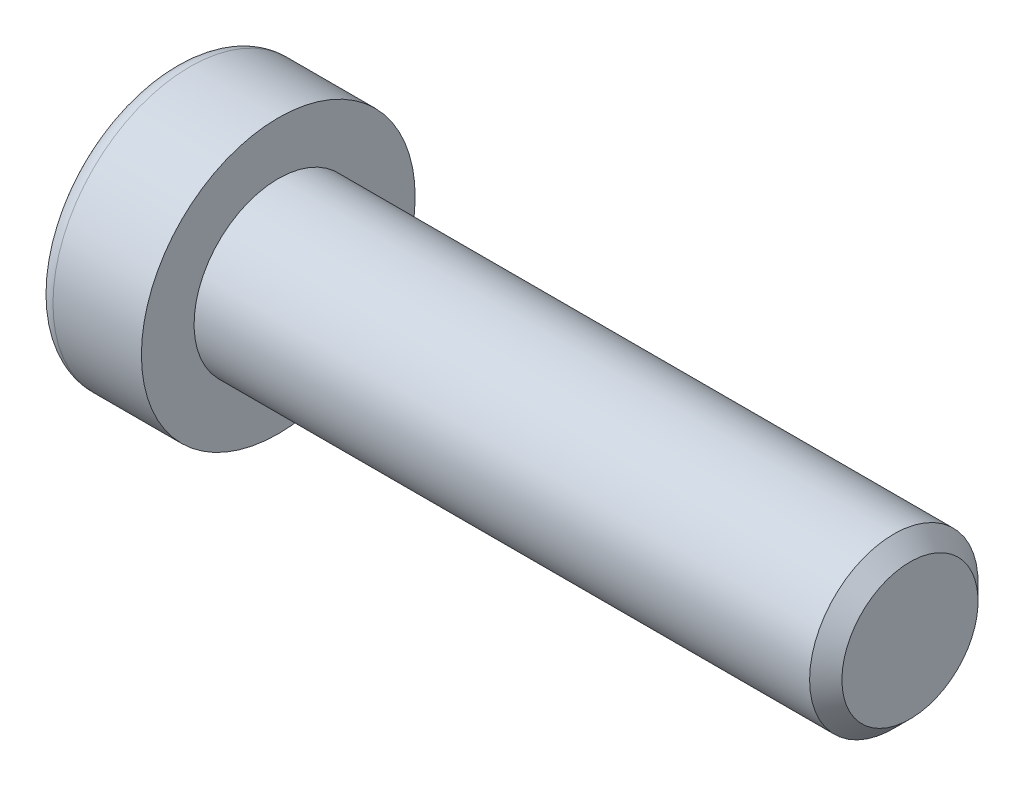
ISO-10303-21;
HEADER;
FILE_DESCRIPTION(('STEP AP214'),'2;1');
FILE_NAME('part.step','',(''),(''),'','','');
FILE_SCHEMA(('AUTOMOTIVE_DESIGN { 1 0 10303 214 1 1 1 1 }'));
ENDSEC;
DATA;
#1=APPLICATION_CONTEXT('core data for automotive mechanical design processes');
#2=APPLICATION_PROTOCOL_DEFINITION('international standard','automotive_design',2000,#1);
#3=PRODUCT_CONTEXT('',#1,'mechanical');
#4=PRODUCT('Part','Part','',(#3));
#5=PRODUCT_RELATED_PRODUCT_CATEGORY('part','',(#4));
#6=PRODUCT_DEFINITION_FORMATION('','',#4);
#7=PRODUCT_DEFINITION_CONTEXT('part definition',#1,'design');
#8=PRODUCT_DEFINITION('design','',#6,#7);
#9=PRODUCT_DEFINITION_SHAPE('','',#8);
#10=(LENGTH_UNIT() NAMED_UNIT(*) SI_UNIT(.MILLI.,.METRE.));
#11=(NAMED_UNIT(*) PLANE_ANGLE_UNIT() SI_UNIT($,.RADIAN.));
#12=(NAMED_UNIT(*) SI_UNIT($,.STERADIAN.) SOLID_ANGLE_UNIT());
#13=UNCERTAINTY_MEASURE_WITH_UNIT(LENGTH_MEASURE(1.E-05),#10,'distance_accuracy_value','');
#14=(GEOMETRIC_REPRESENTATION_CONTEXT(3) GLOBAL_UNCERTAINTY_ASSIGNED_CONTEXT((#13)) GLOBAL_UNIT_ASSIGNED_CONTEXT((#10,
#11,#12)) REPRESENTATION_CONTEXT('',''));
#15=CARTESIAN_POINT('',(0.,0.,0.));
#16=DIRECTION('',(0.,0.,1.));
#17=DIRECTION('',(1.,0.,0.));
#18=AXIS2_PLACEMENT_3D('',#15,#16,#17);
#19=CARTESIAN_POINT('',(-1.21000000177673,0.,0.));
#20=DIRECTION('',(-1.,0.,0.));
#21=DIRECTION('',(0.,0.,1.));
#22=AXIS2_PLACEMENT_3D('',#19,#20,#21);
#23=CONICAL_SURFACE('',#22,2.9040718530382,1.04719754996794);
#24=CARTESIAN_POINT('',(0.466666669012739,-1.13686837721616E-10,0.));
#25=VERTEX_POINT('',#24);
#26=VERTEX_LOOP('',#25);
#27=FACE_BOUND('',#26,.T.);
#28=CARTESIAN_POINT('',(-1.20000000188032,2.50000000042828,1.44337567243126));
#29=CARTESIAN_POINT('',(-1.16336943336427,2.50000000015382,1.31652043353318));
#30=CARTESIAN_POINT('',(-1.13005584831707,2.50000000004123,1.18857018203745));
#31=CARTESIAN_POINT('',(-1.07190798610144,2.49999999995868,0.930454306037677));
#32=CARTESIAN_POINT('',(-1.04709427719735,2.49999999998906,0.800284096806924));
#33=CARTESIAN_POINT('',(-1.00846995036617,2.50000000001067,0.541556812494233));
#34=CARTESIAN_POINT('',(-0.994402236162447,2.50000000000284,0.413039534770439));
#35=CARTESIAN_POINT('',(-0.977611461824864,2.49999999999716,0.155400578562858));
#36=CARTESIAN_POINT('',(-0.974874494142074,2.49999999999929,0.0262798358840899));
#37=CARTESIAN_POINT('',(-0.980582864422355,2.50000000000062,-0.21496841995549));
#38=CARTESIAN_POINT('',(-0.987626608278002,2.50000000000017,-0.327132134383147));
#39=CARTESIAN_POINT('',(-1.00994662771906,2.49999999999983,-0.550728853222557));
#40=CARTESIAN_POINT('',(-1.02523052031715,2.49999999999995,-0.66216108485018));
#41=CARTESIAN_POINT('',(-1.06343729360609,2.50000000000005,-0.886218434015897));
#42=CARTESIAN_POINT('',(-1.08652205474861,2.50000000000003,-0.998815208377872));
#43=CARTESIAN_POINT('',(-1.13891470311393,2.49999999999998,-1.2223298619213));
#44=CARTESIAN_POINT('',(-1.16821028805135,2.49999999999995,-1.33325060237494));
#45=CARTESIAN_POINT('',(-1.20000000215881,2.5,-1.44337567242466));
#46=B_SPLINE_CURVE_WITH_KNOTS('',3,(#28,#29,#30,#31,#32,#33,#34,#35,#36,#37,#38,#39,#40,#41,#42,
#43,#44,#45),.UNSPECIFIED.,.F.,.F.,(4,2,2,2,2,2,2,2,4),(0.,0.396270014515872,0.793492271437725,
1.18088450788727,1.56780111135406,1.90463472821334,2.24178024186127,2.58640202744164,
2.93034746593166),.UNSPECIFIED.);
#47=CARTESIAN_POINT('',(-1.20000000213914,2.49999999973261,1.44337567281968));
#48=VERTEX_POINT('',#47);
#49=CARTESIAN_POINT('',(-1.20000000222827,2.5,-1.44337567266531));
#50=VERTEX_POINT('',#49);
#51=EDGE_CURVE('E19',#48,#50,#46,.T.);
#52=ORIENTED_EDGE('',*,*,#51,.T.);
#53=CARTESIAN_POINT('',(-1.20000000188032,2.49999999974405,-1.44337567361636));
#54=CARTESIAN_POINT('',(-1.16336943336427,2.39014014011794,-1.50680329282772));
#55=CARTESIAN_POINT('',(-1.13005584831707,2.27933197184574,-1.57077841847808));
#56=CARTESIAN_POINT('',(-1.07190798610144,2.05579706606859,-1.69983635640647));
#57=CARTESIAN_POINT('',(-1.04709427719735,1.94306635807401,-1.76492146104816));
#58=CARTESIAN_POINT('',(-1.00846995036617,1.71900195721787,-1.89428510322322));
#59=CARTESIAN_POINT('',(-0.994402236162446,1.60770272987993,-1.95854374207834));
#60=CARTESIAN_POINT('',(-0.977611461824863,1.38458084879682,-2.08736322017721));
#61=CARTESIAN_POINT('',(-0.974874494142074,1.27275900548255,-2.15192359151843));
#62=CARTESIAN_POINT('',(-0.980582864422354,1.06383188730746,-2.27254771943938));
#63=CARTESIAN_POINT('',(-0.987626608278001,0.966695261230055,-2.32862957665281));
#64=CARTESIAN_POINT('',(-1.00994662771905,0.773054822512112,-2.44042793607223));
#65=CARTESIAN_POINT('',(-1.02523052031715,0.676551679122258,-2.49614405188614));
#66=CARTESIAN_POINT('',(-1.06343729360609,0.482512322840195,-2.60817272646909));
#67=CARTESIAN_POINT('',(-1.08652205474861,0.385000655858529,-2.66447111365005));
#68=CARTESIAN_POINT('',(-1.13891470311393,0.191431287771819,-2.77622844042172));
#69=CARTESIAN_POINT('',(-1.16821028805135,0.09537110873237,-2.83168881064853));
#70=CARTESIAN_POINT('',(-1.20000000215881,4.75795613603965E-10,-2.88675134567343));
#71=B_SPLINE_CURVE_WITH_KNOTS('',3,(#53,#54,#55,#56,#57,#58,#59,#60,#61,#62,#63,#64,#65,#66,#67,
#68,#69,#70),.UNSPECIFIED.,.F.,.F.,(4,2,2,2,2,2,2,2,4),(0.,0.396270014515872,0.793492271437724,
1.18088450788727,1.56780111135406,1.90463472821334,2.24178024186127,2.58640202744164,
2.93034746593166),.UNSPECIFIED.);
#72=CARTESIAN_POINT('',(-1.20000000213914,0.,-2.88675134563937));
#73=VERTEX_POINT('',#72);
#74=EDGE_CURVE('E79',#50,#73,#71,.T.);
#75=ORIENTED_EDGE('',*,*,#74,.T.);
#76=CARTESIAN_POINT('',(-1.20000000188032,-6.842196023302E-10,-2.88675134604762));
#77=CARTESIAN_POINT('',(-1.16336943336427,-0.109859860035873,-2.8233237263609));
#78=CARTESIAN_POINT('',(-1.13005584831707,-0.220668028195489,-2.75934860051552));
#79=CARTESIAN_POINT('',(-1.07190798610144,-0.444202933890087,-2.63029066244415));
#80=CARTESIAN_POINT('',(-1.04709427719735,-0.556933641915047,-2.56520555785509));
#81=CARTESIAN_POINT('',(-1.00846995036617,-0.780998042792801,-2.43584191571745));
#82=CARTESIAN_POINT('',(-0.994402236162447,-0.892297270122914,-2.37158327684878));
#83=CARTESIAN_POINT('',(-0.977611461824864,-1.11541915120034,-2.24276379874007));
#84=CARTESIAN_POINT('',(-0.974874494142073,-1.22724099451673,-2.17820342740253));
#85=CARTESIAN_POINT('',(-0.980582864422354,-1.43616811269316,-2.05757929948389));
#86=CARTESIAN_POINT('',(-0.987626608278001,-1.53330473877011,-2.00149744226967));
#87=CARTESIAN_POINT('',(-1.00994662771906,-1.72694517748772,-1.88969908284967));
#88=CARTESIAN_POINT('',(-1.02523052031715,-1.82344832087769,-1.83398296703597));
#89=CARTESIAN_POINT('',(-1.06343729360609,-2.01748767715985,-1.72195429245319));
#90=CARTESIAN_POINT('',(-1.08652205474861,-2.1149993441415,-1.66565590527218));
#91=CARTESIAN_POINT('',(-1.13891470311393,-2.30856871222816,-1.55389857850043));
#92=CARTESIAN_POINT('',(-1.16821028805135,-2.40462889126758,-1.49843820827358));
#93=CARTESIAN_POINT('',(-1.20000000215881,-2.49999999952421,-1.44337567324877));
#94=B_SPLINE_CURVE_WITH_KNOTS('',3,(#76,#77,#78,#79,#80,#81,#82,#83,#84,#85,#86,#87,#88,#89,#90,
#91,#92,#93),.UNSPECIFIED.,.F.,.F.,(4,2,2,2,2,2,2,2,4),(0.,0.396270014515872,0.793492271437725,
1.18088450788727,1.56780111135406,1.90463472821334,2.24178024186127,2.58640202744164,
2.93034746593167),.UNSPECIFIED.);
#95=CARTESIAN_POINT('',(-1.20000000213914,-2.49999999973261,-1.44337567281968));
#96=VERTEX_POINT('',#95);
#97=EDGE_CURVE('E104',#73,#96,#94,.T.);
#98=ORIENTED_EDGE('',*,*,#97,.T.);
#99=CARTESIAN_POINT('',(-1.20000000188032,-2.50000000042828,-1.44337567243126));
#100=CARTESIAN_POINT('',(-1.16336943336427,-2.50000000015382,-1.31652043353318));
#101=CARTESIAN_POINT('',(-1.13005584831707,-2.50000000004123,-1.18857018203745));
#102=CARTESIAN_POINT('',(-1.07190798610144,-2.49999999995868,-0.93045430603768));
#103=CARTESIAN_POINT('',(-1.04709427719735,-2.49999999998906,-0.800284096806928));
#104=CARTESIAN_POINT('',(-1.00846995036617,-2.50000000001067,-0.541556812494236));
#105=CARTESIAN_POINT('',(-0.994402236162447,-2.50000000000284,-0.413039534770443));
#106=CARTESIAN_POINT('',(-0.977611461824863,-2.49999999999716,-0.155400578562862));
#107=CARTESIAN_POINT('',(-0.974874494142073,-2.49999999999929,-0.0262798358840941));
#108=CARTESIAN_POINT('',(-0.980582864422354,-2.50000000000062,0.214968419955486));
#109=CARTESIAN_POINT('',(-0.987626608278001,-2.50000000000017,0.327132134383144));
#110=CARTESIAN_POINT('',(-1.00994662771905,-2.49999999999983,0.550728853222554));
#111=CARTESIAN_POINT('',(-1.02523052031715,-2.49999999999995,0.662161084850177));
#112=CARTESIAN_POINT('',(-1.06343729360609,-2.50000000000005,0.886218434015895));
#113=CARTESIAN_POINT('',(-1.08652205474861,-2.50000000000002,0.99881520837787));
#114=CARTESIAN_POINT('',(-1.13891470311393,-2.49999999999998,1.2223298619213));
#115=CARTESIAN_POINT('',(-1.16821028805135,-2.49999999999995,1.33325060237494));
#116=CARTESIAN_POINT('',(-1.20000000215881,-2.5,1.44337567242466));
#117=B_SPLINE_CURVE_WITH_KNOTS('',3,(#99,#100,#101,#102,#103,#104,#105,#106,#107,#108,#109,#110,
#111,#112,#113,#114,#115,#116),.UNSPECIFIED.,.F.,.F.,(4,2,2,2,2,2,2,2,4),(0.,0.396270014515872,
0.793492271437724,1.18088450788727,1.56780111135406,1.90463472821334,2.24178024186127,
2.58640202744164,2.93034746593167),.UNSPECIFIED.);
#118=CARTESIAN_POINT('',(-1.20000000213914,-2.49999999973261,1.44337567281969));
#119=VERTEX_POINT('',#118);
#120=EDGE_CURVE('E128',#96,#119,#117,.T.);
#121=ORIENTED_EDGE('',*,*,#120,.T.);
#122=CARTESIAN_POINT('',(-1.20000000188032,-2.49999999974406,1.44337567361636));
#123=CARTESIAN_POINT('',(-1.16336943336427,-2.39014014011795,1.50680329282772));
#124=CARTESIAN_POINT('',(-1.13005584831707,-2.27933197184574,1.57077841847807));
#125=CARTESIAN_POINT('',(-1.07190798610144,-2.05579706606859,1.69983635640647));
#126=CARTESIAN_POINT('',(-1.04709427719735,-1.94306635807401,1.76492146104816));
#127=CARTESIAN_POINT('',(-1.00846995036617,-1.71900195721787,1.89428510322322));
#128=CARTESIAN_POINT('',(-0.994402236162447,-1.60770272987993,1.95854374207834));
#129=CARTESIAN_POINT('',(-0.977611461824864,-1.38458084879682,2.08736322017721));
#130=CARTESIAN_POINT('',(-0.974874494142074,-1.27275900548255,2.15192359151843));
#131=CARTESIAN_POINT('',(-0.980582864422354,-1.06383188730746,2.27254771943938));
#132=CARTESIAN_POINT('',(-0.987626608278001,-0.966695261230056,2.32862957665281));
#133=CARTESIAN_POINT('',(-1.00994662771905,-0.773054822512113,2.44042793607223));
#134=CARTESIAN_POINT('',(-1.02523052031715,-0.676551679122259,2.49614405188614));
#135=CARTESIAN_POINT('',(-1.06343729360609,-0.482512322840196,2.60817272646909));
#136=CARTESIAN_POINT('',(-1.08652205474861,-0.385000655858529,2.66447111365005));
#137=CARTESIAN_POINT('',(-1.13891470311393,-0.19143128777182,2.77622844042172));
#138=CARTESIAN_POINT('',(-1.16821028805135,-0.0953711087323703,2.83168881064852));
#139=CARTESIAN_POINT('',(-1.20000000215881,-4.75795563263291E-10,2.88675134567343));
#140=B_SPLINE_CURVE_WITH_KNOTS('',3,(#122,#123,#124,#125,#126,#127,#128,#129,#130,#131,#132,
#133,#134,#135,#136,#137,#138,#139),.UNSPECIFIED.,.F.,.F.,(4,2,2,2,2,2,2,2,4),(0.,
0.396270014515872,0.793492271437724,1.18088450788727,1.56780111135406,1.90463472821334,
2.24178024186127,2.58640202744164,2.93034746593167),.UNSPECIFIED.);
#141=CARTESIAN_POINT('',(-1.20000000213914,0.,2.88675134563937));
#142=VERTEX_POINT('',#141);
#143=EDGE_CURVE('E136',#119,#142,#140,.T.);
#144=ORIENTED_EDGE('',*,*,#143,.T.);
#145=CARTESIAN_POINT('',(-1.20000000188032,6.84218568518227E-10,2.88675134604763));
#146=CARTESIAN_POINT('',(-1.16336943336427,0.109859860035872,2.8233237263609));
#147=CARTESIAN_POINT('',(-1.13005584831707,0.220668028195487,2.75934860051552));
#148=CARTESIAN_POINT('',(-1.07190798610144,0.444202933890086,2.63029066244415));
#149=CARTESIAN_POINT('',(-1.04709427719735,0.556933641915045,2.56520555785509));
#150=CARTESIAN_POINT('',(-1.00846995036617,0.7809980427928,2.43584191571745));
#151=CARTESIAN_POINT('',(-0.994402236162446,0.892297270122912,2.37158327684878));
#152=CARTESIAN_POINT('',(-0.977611461824863,1.11541915120034,2.24276379874007));
#153=CARTESIAN_POINT('',(-0.974874494142073,1.22724099451673,2.17820342740253));
#154=CARTESIAN_POINT('',(-0.980582864422353,1.43616811269316,2.05757929948389));
#155=CARTESIAN_POINT('',(-0.987626608278,1.53330473877011,2.00149744226967));
#156=CARTESIAN_POINT('',(-1.00994662771905,1.72694517748772,1.88969908284967));
#157=CARTESIAN_POINT('',(-1.02523052031715,1.82344832087769,1.83398296703596));
#158=CARTESIAN_POINT('',(-1.06343729360609,2.01748767715985,1.72195429245319));
#159=CARTESIAN_POINT('',(-1.08652205474861,2.1149993441415,1.66565590527218));
#160=CARTESIAN_POINT('',(-1.13891470311393,2.30856871222816,1.55389857850042));
#161=CARTESIAN_POINT('',(-1.16821028805135,2.40462889126758,1.49843820827358));
#162=CARTESIAN_POINT('',(-1.2000000021588,2.49999999952421,1.44337567324876));
#163=B_SPLINE_CURVE_WITH_KNOTS('',3,(#145,#146,#147,#148,#149,#150,#151,#152,#153,#154,#155,
#156,#157,#158,#159,#160,#161,#162),.UNSPECIFIED.,.F.,.F.,(4,2,2,2,2,2,2,2,4),(0.,
0.396270014515872,0.793492271437725,1.18088450788727,1.56780111135406,1.90463472821334,
2.24178024186127,2.58640202744164,2.93034746593167),.UNSPECIFIED.);
#164=EDGE_CURVE('E81',#142,#48,#163,.T.);
#165=ORIENTED_EDGE('',*,*,#164,.T.);
#166=EDGE_LOOP('',(#52,#75,#98,#121,#144,#165));
#167=FACE_BOUND('',#166,.T.);
#168=ADVANCED_FACE('F15',(#27,#167),#23,.F.);
#169=CARTESIAN_POINT('',(-5.,2.5,1.44337567297406));
#170=DIRECTION('',(0.,1.,0.));
#171=DIRECTION('',(0.,0.,1.));
#172=AXIS2_PLACEMENT_3D('',#169,#170,#171);
#173=PLANE('',#172);
#174=DIRECTION('',(1.,0.,0.));
#175=VECTOR('',#174,1.);
#176=CARTESIAN_POINT('',(-5.,2.5,1.44337567297406));
#177=LINE('',#176,#175);
#178=CARTESIAN_POINT('',(-5.,2.5,1.44337567297406));
#179=VERTEX_POINT('',#178);
#180=EDGE_CURVE('E83',#48,#179,#177,.F.);
#181=ORIENTED_EDGE('',*,*,#180,.T.);
#182=DIRECTION('',(0.,0.,1.));
#183=VECTOR('',#182,1.);
#184=CARTESIAN_POINT('',(-5.,2.5,0.));
#185=LINE('',#184,#183);
#186=CARTESIAN_POINT('',(-5.,2.5,-1.44337567297407));
#187=VERTEX_POINT('',#186);
#188=EDGE_CURVE('E88',#187,#179,#185,.T.);
#189=ORIENTED_EDGE('',*,*,#188,.F.);
#190=DIRECTION('',(1.,0.,0.));
#191=VECTOR('',#190,1.);
#192=CARTESIAN_POINT('',(-5.,2.5,-1.44337567297407));
#193=LINE('',#192,#191);
#194=EDGE_CURVE('E86',#187,#50,#193,.T.);
#195=ORIENTED_EDGE('',*,*,#194,.T.);
#196=ORIENTED_EDGE('',*,*,#51,.F.);
#197=EDGE_LOOP('',(#181,#189,#195,#196));
#198=FACE_BOUND('',#197,.T.);
#199=ADVANCED_FACE('F75',(#198),#173,.F.);
#200=CARTESIAN_POINT('',(-5.,0.,2.88675134594813));
#201=DIRECTION('',(0.,0.500000000000001,0.866025403784438));
#202=DIRECTION('',(0.,-0.866025403784438,0.500000000000001));
#203=AXIS2_PLACEMENT_3D('',#200,#201,#202);
#204=PLANE('',#203);
#205=DIRECTION('',(1.,0.,0.));
#206=VECTOR('',#205,1.);
#207=CARTESIAN_POINT('',(-5.,0.,2.88675134594813));
#208=LINE('',#207,#206);
#209=CARTESIAN_POINT('',(-5.,0.,2.88675134594813));
#210=VERTEX_POINT('',#209);
#211=EDGE_CURVE('E140',#142,#210,#208,.F.);
#212=ORIENTED_EDGE('',*,*,#211,.T.);
#213=DIRECTION('',(0.,-0.866025403784438,0.500000000000001));
#214=VECTOR('',#213,1.);
#215=CARTESIAN_POINT('',(-5.,2.5,1.44337567297406));
#216=LINE('',#215,#214);
#217=EDGE_CURVE('E94',#179,#210,#216,.T.);
#218=ORIENTED_EDGE('',*,*,#217,.F.);
#219=ORIENTED_EDGE('',*,*,#180,.F.);
#220=ORIENTED_EDGE('',*,*,#164,.F.);
#221=EDGE_LOOP('',(#212,#218,#219,#220));
#222=FACE_BOUND('',#221,.T.);
#223=ADVANCED_FACE('F144',(#222),#204,.F.);
#224=CARTESIAN_POINT('',(-5.,-2.5,1.44337567297406));
#225=DIRECTION('',(0.,-0.5,0.866025403784439));
#226=DIRECTION('',(0.,-0.866025403784439,-0.5));
#227=AXIS2_PLACEMENT_3D('',#224,#225,#226);
#228=PLANE('',#227);
#229=DIRECTION('',(1.,0.,0.));
#230=VECTOR('',#229,1.);
#231=CARTESIAN_POINT('',(-5.,-2.5,1.44337567297406));
#232=LINE('',#231,#230);
#233=CARTESIAN_POINT('',(-5.,-2.5,1.44337567297406));
#234=VERTEX_POINT('',#233);
#235=EDGE_CURVE('E135',#119,#234,#232,.F.);
#236=ORIENTED_EDGE('',*,*,#235,.T.);
#237=DIRECTION('',(0.,-0.866025403784439,-0.5));
#238=VECTOR('',#237,1.);
#239=CARTESIAN_POINT('',(-5.,0.,2.88675134594813));
#240=LINE('',#239,#238);
#241=EDGE_CURVE('E223',#210,#234,#240,.T.);
#242=ORIENTED_EDGE('',*,*,#241,.F.);
#243=ORIENTED_EDGE('',*,*,#211,.F.);
#244=ORIENTED_EDGE('',*,*,#143,.F.);
#245=EDGE_LOOP('',(#236,#242,#243,#244));
#246=FACE_BOUND('',#245,.T.);
#247=ADVANCED_FACE('F124',(#246),#228,.F.);
#248=CARTESIAN_POINT('',(-5.,-2.5,-1.44337567297406));
#249=DIRECTION('',(0.,-1.,0.));
#250=DIRECTION('',(0.,0.,-1.));
#251=AXIS2_PLACEMENT_3D('',#248,#249,#250);
#252=PLANE('',#251);
#253=DIRECTION('',(1.,0.,0.));
#254=VECTOR('',#253,1.);
#255=CARTESIAN_POINT('',(-5.,-2.5,-1.44337567297406));
#256=LINE('',#255,#254);
#257=CARTESIAN_POINT('',(-5.,-2.5,-1.44337567297406));
#258=VERTEX_POINT('',#257);
#259=EDGE_CURVE('E134',#96,#258,#256,.F.);
#260=ORIENTED_EDGE('',*,*,#259,.T.);
#261=DIRECTION('',(0.,0.,1.));
#262=VECTOR('',#261,1.);
#263=CARTESIAN_POINT('',(-5.,-2.5,0.));
#264=LINE('',#263,#262);
#265=EDGE_CURVE('E220',#234,#258,#264,.F.);
#266=ORIENTED_EDGE('',*,*,#265,.F.);
#267=ORIENTED_EDGE('',*,*,#235,.F.);
#268=ORIENTED_EDGE('',*,*,#120,.F.);
#269=EDGE_LOOP('',(#260,#266,#267,#268));
#270=FACE_BOUND('',#269,.T.);
#271=ADVANCED_FACE('F120',(#270),#252,.F.);
#272=CARTESIAN_POINT('',(-5.,0.,-2.88675134594813));
#273=DIRECTION('',(0.,-0.5,-0.866025403784439));
#274=DIRECTION('',(0.,0.866025403784439,-0.5));
#275=AXIS2_PLACEMENT_3D('',#272,#273,#274);
#276=PLANE('',#275);
#277=DIRECTION('',(1.,0.,0.));
#278=VECTOR('',#277,1.);
#279=CARTESIAN_POINT('',(-5.,0.,-2.88675134594813));
#280=LINE('',#279,#278);
#281=CARTESIAN_POINT('',(-5.,0.,-2.88675134594813));
#282=VERTEX_POINT('',#281);
#283=EDGE_CURVE('E37',#73,#282,#280,.F.);
#284=ORIENTED_EDGE('',*,*,#283,.T.);
#285=DIRECTION('',(0.,0.866025403784438,-0.500000000000001));
#286=VECTOR('',#285,1.);
#287=CARTESIAN_POINT('',(-5.,-2.5,-1.44337567297406));
#288=LINE('',#287,#286);
#289=EDGE_CURVE('E217',#258,#282,#288,.T.);
#290=ORIENTED_EDGE('',*,*,#289,.F.);
#291=ORIENTED_EDGE('',*,*,#259,.F.);
#292=ORIENTED_EDGE('',*,*,#97,.F.);
#293=EDGE_LOOP('',(#284,#290,#291,#292));
#294=FACE_BOUND('',#293,.T.);
#295=ADVANCED_FACE('F114',(#294),#276,.F.);
#296=CARTESIAN_POINT('',(-5.,2.5,-1.44337567297407));
#297=DIRECTION('',(0.,0.5,-0.866025403784439));
#298=DIRECTION('',(0.,0.866025403784439,0.5));
#299=AXIS2_PLACEMENT_3D('',#296,#297,#298);
#300=PLANE('',#299);
#301=ORIENTED_EDGE('',*,*,#194,.F.);
#302=DIRECTION('',(0.,0.866025403784439,0.5));
#303=VECTOR('',#302,1.);
#304=CARTESIAN_POINT('',(-5.,0.,-2.88675134594813));
#305=LINE('',#304,#303);
#306=EDGE_CURVE('E215',#282,#187,#305,.T.);
#307=ORIENTED_EDGE('',*,*,#306,.F.);
#308=ORIENTED_EDGE('',*,*,#283,.F.);
#309=ORIENTED_EDGE('',*,*,#74,.F.);
#310=EDGE_LOOP('',(#301,#307,#308,#309));
#311=FACE_BOUND('',#310,.T.);
#312=ADVANCED_FACE('F92',(#311),#300,.F.);
#313=CARTESIAN_POINT('',(-5.,4.69337567297407,0.));
#314=DIRECTION('',(-1.,0.,0.));
#315=DIRECTION('',(0.,0.,1.));
#316=AXIS2_PLACEMENT_3D('',#313,#314,#315);
#317=PLANE('',#316);
#318=ORIENTED_EDGE('',*,*,#289,.T.);
#319=ORIENTED_EDGE('',*,*,#306,.T.);
#320=ORIENTED_EDGE('',*,*,#188,.T.);
#321=ORIENTED_EDGE('',*,*,#217,.T.);
#322=ORIENTED_EDGE('',*,*,#241,.T.);
#323=ORIENTED_EDGE('',*,*,#265,.T.);
#324=EDGE_LOOP('',(#318,#319,#320,#321,#322,#323));
#325=FACE_BOUND('',#324,.T.);
#326=CARTESIAN_POINT('',(-5.,0.,0.));
#327=DIRECTION('',(1.,0.,0.));
#328=DIRECTION('',(0.,1.,0.));
#329=AXIS2_PLACEMENT_3D('',#326,#327,#328);
#330=CIRCLE('',#329,5.7);
#331=CARTESIAN_POINT('',(-5.,5.7,0.));
#332=VERTEX_POINT('',#331);
#333=EDGE_CURVE('E192',#332,#332,#330,.T.);
#334=ORIENTED_EDGE('',*,*,#333,.F.);
#335=EDGE_LOOP('',(#334));
#336=FACE_BOUND('',#335,.T.);
#337=ADVANCED_FACE('F113',(#325,#336),#317,.T.);
#338=CARTESIAN_POINT('',(-4.2,0.,0.));
#339=DIRECTION('',(1.,0.,0.));
#340=DIRECTION('',(0.,0.,-1.));
#341=AXIS2_PLACEMENT_3D('',#338,#339,#340);
#342=TOROIDAL_SURFACE('',#341,5.7,0.8);
#343=CARTESIAN_POINT('',(-4.2,0.,0.));
#344=DIRECTION('',(1.,0.,0.));
#345=DIRECTION('',(0.,1.,0.));
#346=AXIS2_PLACEMENT_3D('',#343,#344,#345);
#347=CIRCLE('',#346,6.5);
#348=CARTESIAN_POINT('',(-4.2,6.5,0.));
#349=VERTEX_POINT('',#348);
#350=EDGE_CURVE('E233',#349,#349,#347,.T.);
#351=ORIENTED_EDGE('',*,*,#350,.F.);
#352=EDGE_LOOP('',(#351));
#353=FACE_BOUND('',#352,.T.);
#354=ORIENTED_EDGE('',*,*,#333,.T.);
#355=EDGE_LOOP('',(#354));
#356=FACE_BOUND('',#355,.T.);
#357=ADVANCED_FACE('F176',(#353,#356),#342,.T.);
#358=CARTESIAN_POINT('',(-2.5,0.,0.));
#359=DIRECTION('',(1.,0.,0.));
#360=DIRECTION('',(0.,1.,0.));
#361=AXIS2_PLACEMENT_3D('',#358,#359,#360);
#362=CYLINDRICAL_SURFACE('',#361,6.5);
#363=ORIENTED_EDGE('',*,*,#350,.T.);
#364=EDGE_LOOP('',(#363));
#365=FACE_BOUND('',#364,.T.);
#366=CARTESIAN_POINT('',(0.,0.,0.));
#367=DIRECTION('',(1.,0.,0.));
#368=DIRECTION('',(0.,1.,0.));
#369=AXIS2_PLACEMENT_3D('',#366,#367,#368);
#370=CIRCLE('',#369,6.5);
#371=CARTESIAN_POINT('',(0.,6.5,0.));
#372=VERTEX_POINT('',#371);
#373=EDGE_CURVE('E102',#372,#372,#370,.T.);
#374=ORIENTED_EDGE('',*,*,#373,.F.);
#375=EDGE_LOOP('',(#374));
#376=FACE_BOUND('',#375,.T.);
#377=ADVANCED_FACE('F173',(#365,#376),#362,.T.);
#378=CARTESIAN_POINT('',(30.,2.,0.));
#379=DIRECTION('',(1.,0.,0.));
#380=DIRECTION('',(0.,0.,-1.));
#381=AXIS2_PLACEMENT_3D('',#378,#379,#380);
#382=PLANE('',#381);
#383=CARTESIAN_POINT('',(30.0000000003138,0.,0.));
#384=DIRECTION('',(-1.,0.,0.));
#385=DIRECTION('',(0.,0.,1.));
#386=AXIS2_PLACEMENT_3D('',#383,#384,#385);
#387=CIRCLE('',#386,3.2331875003706);
#388=CARTESIAN_POINT('',(30.0000000003138,0.,3.2331875003706));
#389=VERTEX_POINT('',#388);
#390=EDGE_CURVE('E229',#389,#389,#387,.T.);
#391=ORIENTED_EDGE('',*,*,#390,.F.);
#392=EDGE_LOOP('',(#391));
#393=FACE_BOUND('',#392,.T.);
#394=ADVANCED_FACE('F169',(#393),#382,.T.);
#395=CARTESIAN_POINT('',(0.,5.25,0.));
#396=DIRECTION('',(1.,0.,0.));
#397=DIRECTION('',(0.,0.,-1.));
#398=AXIS2_PLACEMENT_3D('',#395,#396,#397);
#399=PLANE('',#398);
#400=CARTESIAN_POINT('',(0.,0.,0.));
#401=DIRECTION('',(1.,0.,0.));
#402=DIRECTION('',(0.,1.,0.));
#403=AXIS2_PLACEMENT_3D('',#400,#401,#402);
#404=CIRCLE('',#403,4.);
#405=CARTESIAN_POINT('',(0.,4.,0.));
#406=VERTEX_POINT('',#405);
#407=EDGE_CURVE('E28',#406,#406,#404,.T.);
#408=ORIENTED_EDGE('',*,*,#407,.F.);
#409=EDGE_LOOP('',(#408));
#410=FACE_BOUND('',#409,.T.);
#411=ORIENTED_EDGE('',*,*,#373,.T.);
#412=EDGE_LOOP('',(#411));
#413=FACE_BOUND('',#412,.T.);
#414=ADVANCED_FACE('F162',(#410,#413),#399,.T.);
#415=CARTESIAN_POINT('',(29.2331874996989,0.,0.));
#416=DIRECTION('',(-1.,0.,0.));
#417=DIRECTION('',(0.,0.,1.));
#418=AXIS2_PLACEMENT_3D('',#415,#416,#417);
#419=CONICAL_SURFACE('',#418,3.99999999967804,0.785398162544959);
#420=ORIENTED_EDGE('',*,*,#390,.T.);
#421=EDGE_LOOP('',(#420));
#422=FACE_BOUND('',#421,.T.);
#423=CARTESIAN_POINT('',(29.2331875,0.,0.));
#424=DIRECTION('',(1.,0.,0.));
#425=DIRECTION('',(0.,1.,0.));
#426=AXIS2_PLACEMENT_3D('',#423,#424,#425);
#427=CIRCLE('',#426,4.);
#428=CARTESIAN_POINT('',(29.2331875,4.,0.));
#429=VERTEX_POINT('',#428);
#430=EDGE_CURVE('E10',#429,#429,#427,.F.);
#431=ORIENTED_EDGE('',*,*,#430,.F.);
#432=EDGE_LOOP('',(#431));
#433=FACE_BOUND('',#432,.T.);
#434=ADVANCED_FACE('F155',(#422,#433),#419,.T.);
#435=CARTESIAN_POINT('',(16.875,0.,0.));
#436=DIRECTION('',(1.,0.,0.));
#437=DIRECTION('',(0.,1.,0.));
#438=AXIS2_PLACEMENT_3D('',#435,#436,#437);
#439=CYLINDRICAL_SURFACE('',#438,4.);
#440=ORIENTED_EDGE('',*,*,#430,.T.);
#441=EDGE_LOOP('',(#440));
#442=FACE_BOUND('',#441,.T.);
#443=ORIENTED_EDGE('',*,*,#407,.T.);
#444=EDGE_LOOP('',(#443));
#445=FACE_BOUND('',#444,.T.);
#446=ADVANCED_FACE('F153',(#442,#445),#439,.T.);
#447=CLOSED_SHELL('',(#168,#199,#223,#247,#271,#295,#312,#337,#357,#377,#394,#414,#434,#446));
#448=MANIFOLD_SOLID_BREP('B1',#447);
#449=ADVANCED_BREP_SHAPE_REPRESENTATION('',(#18,#448),#14);
#450=SHAPE_DEFINITION_REPRESENTATION(#9,#449);
ENDSEC;
END-ISO-10303-21;
